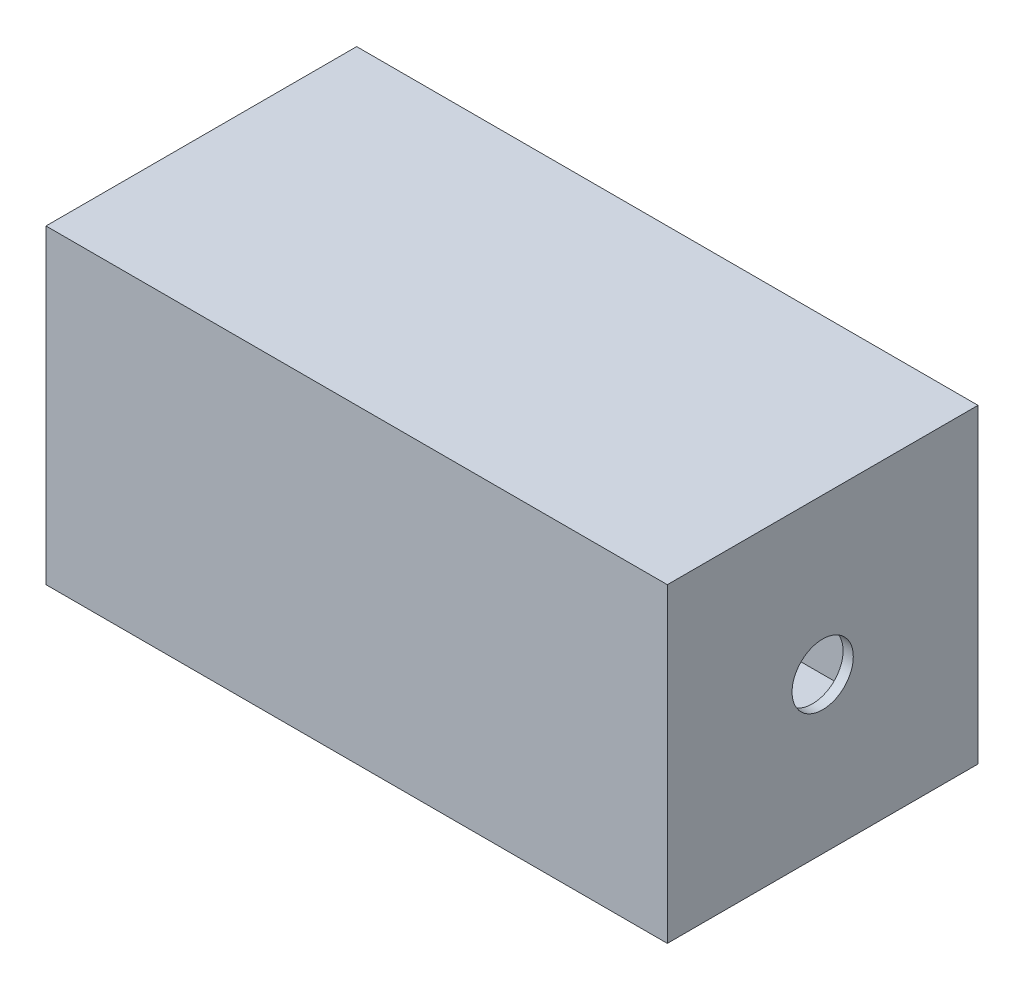
ISO-10303-21;
HEADER;
FILE_DESCRIPTION(('STEP AP214'),'2;1');
FILE_NAME('part.step','',(''),(''),'','','');
FILE_SCHEMA(('AUTOMOTIVE_DESIGN { 1 0 10303 214 1 1 1 1 }'));
ENDSEC;
DATA;
#1=APPLICATION_CONTEXT('core data for automotive mechanical design processes');
#2=APPLICATION_PROTOCOL_DEFINITION('international standard','automotive_design',2000,#1);
#3=PRODUCT_CONTEXT('',#1,'mechanical');
#4=PRODUCT('Part','Part','',(#3));
#5=PRODUCT_RELATED_PRODUCT_CATEGORY('part','',(#4));
#6=PRODUCT_DEFINITION_FORMATION('','',#4);
#7=PRODUCT_DEFINITION_CONTEXT('part definition',#1,'design');
#8=PRODUCT_DEFINITION('design','',#6,#7);
#9=PRODUCT_DEFINITION_SHAPE('','',#8);
#10=(LENGTH_UNIT() NAMED_UNIT(*) SI_UNIT(.MILLI.,.METRE.));
#11=(NAMED_UNIT(*) PLANE_ANGLE_UNIT() SI_UNIT($,.RADIAN.));
#12=(NAMED_UNIT(*) SI_UNIT($,.STERADIAN.) SOLID_ANGLE_UNIT());
#13=UNCERTAINTY_MEASURE_WITH_UNIT(LENGTH_MEASURE(1.E-05),#10,'distance_accuracy_value','');
#14=(GEOMETRIC_REPRESENTATION_CONTEXT(3) GLOBAL_UNCERTAINTY_ASSIGNED_CONTEXT((#13)) GLOBAL_UNIT_ASSIGNED_CONTEXT((#10,
#11,#12)) REPRESENTATION_CONTEXT('',''));
#15=CARTESIAN_POINT('',(0.,0.,0.));
#16=DIRECTION('',(0.,0.,1.));
#17=DIRECTION('',(1.,0.,0.));
#18=AXIS2_PLACEMENT_3D('',#15,#16,#17);
#19=CARTESIAN_POINT('',(305.,305.,-152.5));
#20=DIRECTION('',(-1.,0.,0.));
#21=DIRECTION('',(0.,0.,1.));
#22=AXIS2_PLACEMENT_3D('',#19,#20,#21);
#23=PLANE('',#22);
#24=CARTESIAN_POINT('',(305.,152.5,-1.11538742292249E-13));
#25=DIRECTION('',(1.,0.,0.));
#26=DIRECTION('',(0.,0.,-1.));
#27=AXIS2_PLACEMENT_3D('',#24,#25,#26);
#28=CIRCLE('',#27,30.0753323424348);
#29=CARTESIAN_POINT('',(305.,152.5,-30.0753323424349));
#30=VERTEX_POINT('',#29);
#31=EDGE_CURVE('E143',#30,#30,#28,.T.);
#32=ORIENTED_EDGE('',*,*,#31,.F.);
#33=EDGE_LOOP('',(#32));
#34=FACE_BOUND('',#33,.T.);
#35=DIRECTION('',(0.,0.,-1.));
#36=VECTOR('',#35,1.);
#37=CARTESIAN_POINT('',(305.,0.,-152.5));
#38=LINE('',#37,#36);
#39=CARTESIAN_POINT('',(305.,0.,152.5));
#40=VERTEX_POINT('',#39);
#41=CARTESIAN_POINT('',(305.,0.,-152.5));
#42=VERTEX_POINT('',#41);
#43=EDGE_CURVE('E140',#40,#42,#38,.T.);
#44=ORIENTED_EDGE('',*,*,#43,.T.);
#45=DIRECTION('',(0.,-1.,0.));
#46=VECTOR('',#45,1.);
#47=CARTESIAN_POINT('',(305.,305.,-152.5));
#48=LINE('',#47,#46);
#49=CARTESIAN_POINT('',(305.,305.,-152.5));
#50=VERTEX_POINT('',#49);
#51=EDGE_CURVE('E131',#50,#42,#48,.T.);
#52=ORIENTED_EDGE('',*,*,#51,.F.);
#53=DIRECTION('',(0.,0.,-1.));
#54=VECTOR('',#53,1.);
#55=CARTESIAN_POINT('',(305.,305.,-152.5));
#56=LINE('',#55,#54);
#57=CARTESIAN_POINT('',(305.,305.,152.5));
#58=VERTEX_POINT('',#57);
#59=EDGE_CURVE('E125',#58,#50,#56,.T.);
#60=ORIENTED_EDGE('',*,*,#59,.F.);
#61=DIRECTION('',(0.,-1.,0.));
#62=VECTOR('',#61,1.);
#63=CARTESIAN_POINT('',(305.,305.,152.5));
#64=LINE('',#63,#62);
#65=EDGE_CURVE('E136',#58,#40,#64,.T.);
#66=ORIENTED_EDGE('',*,*,#65,.T.);
#67=EDGE_LOOP('',(#44,#52,#60,#66));
#68=FACE_BOUND('',#67,.T.);
#69=ADVANCED_FACE('F35',(#34,#68),#23,.F.);
#70=CARTESIAN_POINT('',(-305.,305.,-152.5));
#71=DIRECTION('',(0.,0.,1.));
#72=DIRECTION('',(1.,0.,0.));
#73=AXIS2_PLACEMENT_3D('',#70,#71,#72);
#74=PLANE('',#73);
#75=DIRECTION('',(-1.,0.,0.));
#76=VECTOR('',#75,1.);
#77=CARTESIAN_POINT('',(-305.,0.,-152.5));
#78=LINE('',#77,#76);
#79=CARTESIAN_POINT('',(-305.,0.,-152.5));
#80=VERTEX_POINT('',#79);
#81=EDGE_CURVE('E130',#42,#80,#78,.T.);
#82=ORIENTED_EDGE('',*,*,#81,.T.);
#83=DIRECTION('',(0.,-1.,0.));
#84=VECTOR('',#83,1.);
#85=CARTESIAN_POINT('',(-305.,305.,-152.5));
#86=LINE('',#85,#84);
#87=CARTESIAN_POINT('',(-305.,305.,-152.5));
#88=VERTEX_POINT('',#87);
#89=EDGE_CURVE('E128',#88,#80,#86,.T.);
#90=ORIENTED_EDGE('',*,*,#89,.F.);
#91=DIRECTION('',(-1.,0.,0.));
#92=VECTOR('',#91,1.);
#93=CARTESIAN_POINT('',(-305.,305.,-152.5));
#94=LINE('',#93,#92);
#95=EDGE_CURVE('E120',#50,#88,#94,.T.);
#96=ORIENTED_EDGE('',*,*,#95,.F.);
#97=ORIENTED_EDGE('',*,*,#51,.T.);
#98=EDGE_LOOP('',(#82,#90,#96,#97));
#99=FACE_BOUND('',#98,.T.);
#100=ADVANCED_FACE('F129',(#99),#74,.F.);
#101=CARTESIAN_POINT('',(-305.,305.,-152.5));
#102=DIRECTION('',(1.,0.,0.));
#103=DIRECTION('',(0.,0.,-1.));
#104=AXIS2_PLACEMENT_3D('',#101,#102,#103);
#105=PLANE('',#104);
#106=DIRECTION('',(0.,0.,1.));
#107=VECTOR('',#106,1.);
#108=CARTESIAN_POINT('',(-305.,0.,-152.5));
#109=LINE('',#108,#107);
#110=CARTESIAN_POINT('',(-305.,0.,152.5));
#111=VERTEX_POINT('',#110);
#112=EDGE_CURVE('E106',#80,#111,#109,.T.);
#113=ORIENTED_EDGE('',*,*,#112,.T.);
#114=DIRECTION('',(0.,-1.,0.));
#115=VECTOR('',#114,1.);
#116=CARTESIAN_POINT('',(-305.,305.,152.5));
#117=LINE('',#116,#115);
#118=CARTESIAN_POINT('',(-305.,305.,152.5));
#119=VERTEX_POINT('',#118);
#120=EDGE_CURVE('E132',#119,#111,#117,.T.);
#121=ORIENTED_EDGE('',*,*,#120,.F.);
#122=DIRECTION('',(0.,0.,1.));
#123=VECTOR('',#122,1.);
#124=CARTESIAN_POINT('',(-305.,305.,-152.5));
#125=LINE('',#124,#123);
#126=EDGE_CURVE('E123',#88,#119,#125,.T.);
#127=ORIENTED_EDGE('',*,*,#126,.F.);
#128=ORIENTED_EDGE('',*,*,#89,.T.);
#129=EDGE_LOOP('',(#113,#121,#127,#128));
#130=FACE_BOUND('',#129,.T.);
#131=ADVANCED_FACE('F134',(#130),#105,.F.);
#132=CARTESIAN_POINT('',(-305.,305.,152.5));
#133=DIRECTION('',(0.,0.,-1.));
#134=DIRECTION('',(-1.,0.,0.));
#135=AXIS2_PLACEMENT_3D('',#132,#133,#134);
#136=PLANE('',#135);
#137=DIRECTION('',(1.,0.,0.));
#138=VECTOR('',#137,1.);
#139=CARTESIAN_POINT('',(-305.,0.,152.5));
#140=LINE('',#139,#138);
#141=EDGE_CURVE('E112',#111,#40,#140,.T.);
#142=ORIENTED_EDGE('',*,*,#141,.T.);
#143=ORIENTED_EDGE('',*,*,#65,.F.);
#144=DIRECTION('',(1.,0.,0.));
#145=VECTOR('',#144,1.);
#146=CARTESIAN_POINT('',(-305.,305.,152.5));
#147=LINE('',#146,#145);
#148=EDGE_CURVE('E89',#119,#58,#147,.T.);
#149=ORIENTED_EDGE('',*,*,#148,.F.);
#150=ORIENTED_EDGE('',*,*,#120,.T.);
#151=EDGE_LOOP('',(#142,#143,#149,#150));
#152=FACE_BOUND('',#151,.T.);
#153=ADVANCED_FACE('F260',(#152),#136,.F.);
#154=CARTESIAN_POINT('',(0.,305.,0.));
#155=DIRECTION('',(0.,1.,0.));
#156=DIRECTION('',(0.,0.,1.));
#157=AXIS2_PLACEMENT_3D('',#154,#155,#156);
#158=PLANE('',#157);
#159=ORIENTED_EDGE('',*,*,#59,.T.);
#160=ORIENTED_EDGE('',*,*,#95,.T.);
#161=ORIENTED_EDGE('',*,*,#126,.T.);
#162=ORIENTED_EDGE('',*,*,#148,.T.);
#163=EDGE_LOOP('',(#159,#160,#161,#162));
#164=FACE_BOUND('',#163,.T.);
#165=ADVANCED_FACE('F121',(#164),#158,.T.);
#166=CARTESIAN_POINT('',(0.,0.,0.));
#167=DIRECTION('',(0.,1.,0.));
#168=DIRECTION('',(0.,0.,1.));
#169=AXIS2_PLACEMENT_3D('',#166,#167,#168);
#170=PLANE('',#169);
#171=ORIENTED_EDGE('',*,*,#43,.F.);
#172=ORIENTED_EDGE('',*,*,#141,.F.);
#173=ORIENTED_EDGE('',*,*,#112,.F.);
#174=ORIENTED_EDGE('',*,*,#81,.F.);
#175=EDGE_LOOP('',(#171,#172,#173,#174));
#176=FACE_BOUND('',#175,.T.);
#177=ADVANCED_FACE('F240',(#176),#170,.F.);
#178=CARTESIAN_POINT('',(-305.001,152.5,-1.11538742292249E-13));
#179=DIRECTION('',(1.,0.,0.));
#180=DIRECTION('',(0.,0.,-1.));
#181=AXIS2_PLACEMENT_3D('',#178,#179,#180);
#182=CYLINDRICAL_SURFACE('',#181,30.0753323424348);
#183=CARTESIAN_POINT('',(295.,152.5,-1.11538742292249E-13));
#184=DIRECTION('',(-1.,0.,0.));
#185=DIRECTION('',(0.,0.,1.));
#186=AXIS2_PLACEMENT_3D('',#183,#184,#185);
#187=CIRCLE('',#186,30.0753323424348);
#188=CARTESIAN_POINT('',(295.,152.5,30.0753323424346));
#189=VERTEX_POINT('',#188);
#190=EDGE_CURVE('E321',#189,#189,#187,.F.);
#191=ORIENTED_EDGE('',*,*,#190,.F.);
#192=EDGE_LOOP('',(#191));
#193=FACE_BOUND('',#192,.T.);
#194=ORIENTED_EDGE('',*,*,#31,.T.);
#195=EDGE_LOOP('',(#194));
#196=FACE_BOUND('',#195,.T.);
#197=ADVANCED_FACE('F202',(#193,#196),#182,.F.);
#198=CARTESIAN_POINT('',(295.,305.,-152.5));
#199=DIRECTION('',(-1.,0.,0.));
#200=DIRECTION('',(0.,0.,1.));
#201=AXIS2_PLACEMENT_3D('',#198,#199,#200);
#202=PLANE('',#201);
#203=ORIENTED_EDGE('',*,*,#190,.T.);
#204=EDGE_LOOP('',(#203));
#205=FACE_BOUND('',#204,.T.);
#206=DIRECTION('',(0.,0.,-1.));
#207=VECTOR('',#206,1.);
#208=CARTESIAN_POINT('',(295.,10.,-152.5));
#209=LINE('',#208,#207);
#210=CARTESIAN_POINT('',(295.,10.,142.5));
#211=VERTEX_POINT('',#210);
#212=CARTESIAN_POINT('',(295.,10.,-142.5));
#213=VERTEX_POINT('',#212);
#214=EDGE_CURVE('E39',#211,#213,#209,.T.);
#215=ORIENTED_EDGE('',*,*,#214,.F.);
#216=DIRECTION('',(0.,-1.,0.));
#217=VECTOR('',#216,1.);
#218=CARTESIAN_POINT('',(295.,305.,142.5));
#219=LINE('',#218,#217);
#220=CARTESIAN_POINT('',(295.,295.,142.5));
#221=VERTEX_POINT('',#220);
#222=EDGE_CURVE('E165',#221,#211,#219,.T.);
#223=ORIENTED_EDGE('',*,*,#222,.F.);
#224=DIRECTION('',(0.,0.,-1.));
#225=VECTOR('',#224,1.);
#226=CARTESIAN_POINT('',(295.,295.,-152.5));
#227=LINE('',#226,#225);
#228=CARTESIAN_POINT('',(295.,295.,-142.5));
#229=VERTEX_POINT('',#228);
#230=EDGE_CURVE('E152',#221,#229,#227,.T.);
#231=ORIENTED_EDGE('',*,*,#230,.T.);
#232=DIRECTION('',(0.,-1.,0.));
#233=VECTOR('',#232,1.);
#234=CARTESIAN_POINT('',(295.,305.,-142.5));
#235=LINE('',#234,#233);
#236=EDGE_CURVE('E163',#229,#213,#235,.T.);
#237=ORIENTED_EDGE('',*,*,#236,.T.);
#238=EDGE_LOOP('',(#215,#223,#231,#237));
#239=FACE_BOUND('',#238,.T.);
#240=ADVANCED_FACE('F172',(#205,#239),#202,.T.);
#241=CARTESIAN_POINT('',(-305.,305.,-142.5));
#242=DIRECTION('',(0.,0.,1.));
#243=DIRECTION('',(1.,0.,0.));
#244=AXIS2_PLACEMENT_3D('',#241,#242,#243);
#245=PLANE('',#244);
#246=DIRECTION('',(-1.,0.,0.));
#247=VECTOR('',#246,1.);
#248=CARTESIAN_POINT('',(-305.,10.,-142.5));
#249=LINE('',#248,#247);
#250=CARTESIAN_POINT('',(-295.,10.,-142.5));
#251=VERTEX_POINT('',#250);
#252=EDGE_CURVE('E54',#213,#251,#249,.T.);
#253=ORIENTED_EDGE('',*,*,#252,.F.);
#254=ORIENTED_EDGE('',*,*,#236,.F.);
#255=DIRECTION('',(-1.,0.,0.));
#256=VECTOR('',#255,1.);
#257=CARTESIAN_POINT('',(-305.,295.,-142.5));
#258=LINE('',#257,#256);
#259=CARTESIAN_POINT('',(-295.,295.,-142.5));
#260=VERTEX_POINT('',#259);
#261=EDGE_CURVE('E77',#229,#260,#258,.T.);
#262=ORIENTED_EDGE('',*,*,#261,.T.);
#263=DIRECTION('',(0.,-1.,0.));
#264=VECTOR('',#263,1.);
#265=CARTESIAN_POINT('',(-295.,305.,-142.5));
#266=LINE('',#265,#264);
#267=EDGE_CURVE('E159',#260,#251,#266,.T.);
#268=ORIENTED_EDGE('',*,*,#267,.T.);
#269=EDGE_LOOP('',(#253,#254,#262,#268));
#270=FACE_BOUND('',#269,.T.);
#271=ADVANCED_FACE('F173',(#270),#245,.T.);
#272=CARTESIAN_POINT('',(-295.,305.,-152.5));
#273=DIRECTION('',(1.,0.,0.));
#274=DIRECTION('',(0.,0.,-1.));
#275=AXIS2_PLACEMENT_3D('',#272,#273,#274);
#276=PLANE('',#275);
#277=DIRECTION('',(0.,0.,1.));
#278=VECTOR('',#277,1.);
#279=CARTESIAN_POINT('',(-295.,10.,-152.5));
#280=LINE('',#279,#278);
#281=CARTESIAN_POINT('',(-295.,10.,142.5));
#282=VERTEX_POINT('',#281);
#283=EDGE_CURVE('E161',#251,#282,#280,.T.);
#284=ORIENTED_EDGE('',*,*,#283,.F.);
#285=ORIENTED_EDGE('',*,*,#267,.F.);
#286=DIRECTION('',(0.,0.,1.));
#287=VECTOR('',#286,1.);
#288=CARTESIAN_POINT('',(-295.,295.,-152.5));
#289=LINE('',#288,#287);
#290=CARTESIAN_POINT('',(-295.,295.,142.5));
#291=VERTEX_POINT('',#290);
#292=EDGE_CURVE('E45',#260,#291,#289,.T.);
#293=ORIENTED_EDGE('',*,*,#292,.T.);
#294=DIRECTION('',(0.,-1.,0.));
#295=VECTOR('',#294,1.);
#296=CARTESIAN_POINT('',(-295.,305.,142.5));
#297=LINE('',#296,#295);
#298=EDGE_CURVE('E154',#291,#282,#297,.T.);
#299=ORIENTED_EDGE('',*,*,#298,.T.);
#300=EDGE_LOOP('',(#284,#285,#293,#299));
#301=FACE_BOUND('',#300,.T.);
#302=ADVANCED_FACE('F177',(#301),#276,.T.);
#303=CARTESIAN_POINT('',(-305.,305.,142.5));
#304=DIRECTION('',(0.,0.,-1.));
#305=DIRECTION('',(-1.,0.,0.));
#306=AXIS2_PLACEMENT_3D('',#303,#304,#305);
#307=PLANE('',#306);
#308=DIRECTION('',(1.,0.,0.));
#309=VECTOR('',#308,1.);
#310=CARTESIAN_POINT('',(-305.,10.,142.5));
#311=LINE('',#310,#309);
#312=EDGE_CURVE('E157',#282,#211,#311,.T.);
#313=ORIENTED_EDGE('',*,*,#312,.F.);
#314=ORIENTED_EDGE('',*,*,#298,.F.);
#315=DIRECTION('',(1.,0.,0.));
#316=VECTOR('',#315,1.);
#317=CARTESIAN_POINT('',(-305.,295.,142.5));
#318=LINE('',#317,#316);
#319=EDGE_CURVE('E11',#291,#221,#318,.T.);
#320=ORIENTED_EDGE('',*,*,#319,.T.);
#321=ORIENTED_EDGE('',*,*,#222,.T.);
#322=EDGE_LOOP('',(#313,#314,#320,#321));
#323=FACE_BOUND('',#322,.T.);
#324=ADVANCED_FACE('F181',(#323),#307,.T.);
#325=CARTESIAN_POINT('',(0.,295.,0.));
#326=DIRECTION('',(0.,1.,0.));
#327=DIRECTION('',(0.,0.,1.));
#328=AXIS2_PLACEMENT_3D('',#325,#326,#327);
#329=PLANE('',#328);
#330=ORIENTED_EDGE('',*,*,#230,.F.);
#331=ORIENTED_EDGE('',*,*,#319,.F.);
#332=ORIENTED_EDGE('',*,*,#292,.F.);
#333=ORIENTED_EDGE('',*,*,#261,.F.);
#334=EDGE_LOOP('',(#330,#331,#332,#333));
#335=FACE_BOUND('',#334,.T.);
#336=ADVANCED_FACE('F180',(#335),#329,.F.);
#337=CARTESIAN_POINT('',(0.,10.,0.));
#338=DIRECTION('',(0.,1.,0.));
#339=DIRECTION('',(0.,0.,1.));
#340=AXIS2_PLACEMENT_3D('',#337,#338,#339);
#341=PLANE('',#340);
#342=ORIENTED_EDGE('',*,*,#214,.T.);
#343=ORIENTED_EDGE('',*,*,#252,.T.);
#344=ORIENTED_EDGE('',*,*,#283,.T.);
#345=ORIENTED_EDGE('',*,*,#312,.T.);
#346=EDGE_LOOP('',(#342,#343,#344,#345));
#347=FACE_BOUND('',#346,.T.);
#348=ADVANCED_FACE('F37',(#347),#341,.T.);
#349=CLOSED_SHELL('',(#69,#100,#131,#153,#165,#177,#197,#240,#271,#302,#324,#336,#348));
#350=MANIFOLD_SOLID_BREP('B2',#349);
#351=ADVANCED_BREP_SHAPE_REPRESENTATION('',(#18,#350),#14);
#352=SHAPE_DEFINITION_REPRESENTATION(#9,#351);
ENDSEC;
END-ISO-10303-21;
